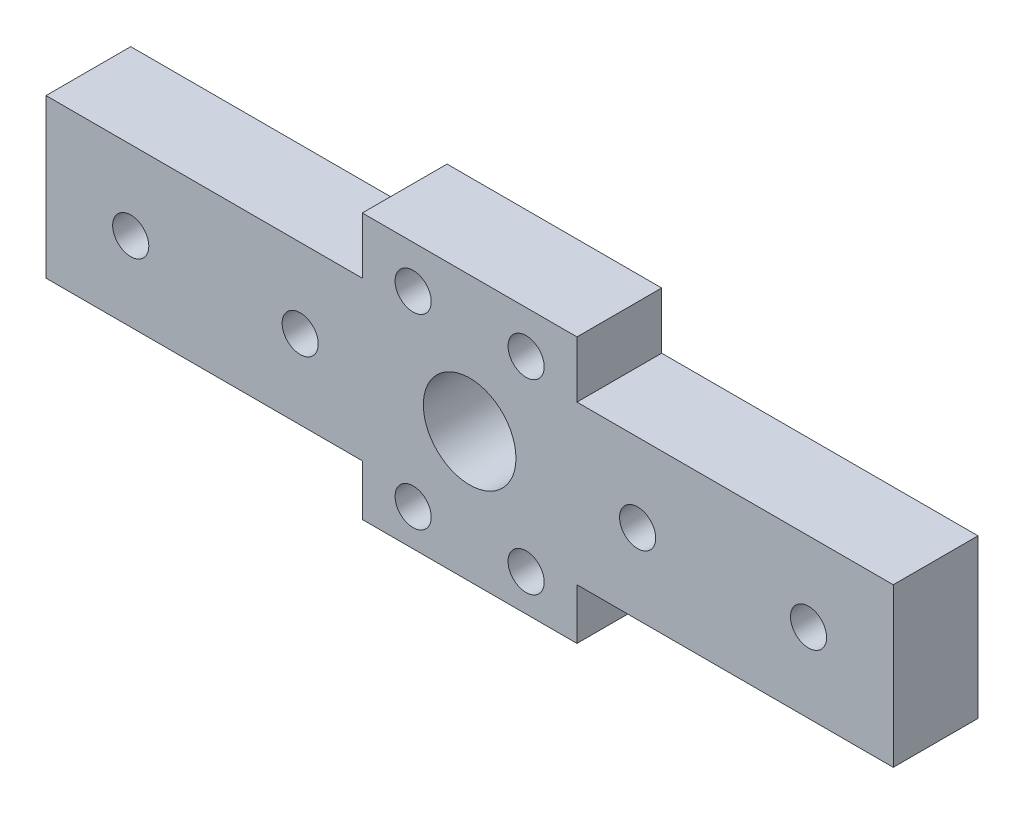
ISO-10303-21;
HEADER;
FILE_DESCRIPTION(('STEP AP214'),'2;1');
FILE_NAME('part.step','',(''),(''),'','','');
FILE_SCHEMA(('AUTOMOTIVE_DESIGN { 1 0 10303 214 1 1 1 1 }'));
ENDSEC;
DATA;
#1=APPLICATION_CONTEXT('core data for automotive mechanical design processes');
#2=APPLICATION_PROTOCOL_DEFINITION('international standard','automotive_design',2000,#1);
#3=PRODUCT_CONTEXT('',#1,'mechanical');
#4=PRODUCT('Part','Part','',(#3));
#5=PRODUCT_RELATED_PRODUCT_CATEGORY('part','',(#4));
#6=PRODUCT_DEFINITION_FORMATION('','',#4);
#7=PRODUCT_DEFINITION_CONTEXT('part definition',#1,'design');
#8=PRODUCT_DEFINITION('design','',#6,#7);
#9=PRODUCT_DEFINITION_SHAPE('','',#8);
#10=(LENGTH_UNIT() NAMED_UNIT(*) SI_UNIT(.MILLI.,.METRE.));
#11=(NAMED_UNIT(*) PLANE_ANGLE_UNIT() SI_UNIT($,.RADIAN.));
#12=(NAMED_UNIT(*) SI_UNIT($,.STERADIAN.) SOLID_ANGLE_UNIT());
#13=UNCERTAINTY_MEASURE_WITH_UNIT(LENGTH_MEASURE(1.E-05),#10,'distance_accuracy_value','');
#14=(GEOMETRIC_REPRESENTATION_CONTEXT(3) GLOBAL_UNCERTAINTY_ASSIGNED_CONTEXT((#13)) GLOBAL_UNIT_ASSIGNED_CONTEXT((#10,
#11,#12)) REPRESENTATION_CONTEXT('',''));
#15=CARTESIAN_POINT('',(0.,0.,0.));
#16=DIRECTION('',(0.,0.,1.));
#17=DIRECTION('',(1.,0.,0.));
#18=AXIS2_PLACEMENT_3D('',#15,#16,#17);
#19=CARTESIAN_POINT('',(0.,0.,7.5));
#20=DIRECTION('',(0.,0.,-1.));
#21=DIRECTION('',(-1.,0.,0.));
#22=AXIS2_PLACEMENT_3D('',#19,#20,#21);
#23=PLANE('',#22);
#24=DIRECTION('',(0.,-1.,0.));
#25=VECTOR('',#24,1.);
#26=CARTESIAN_POINT('',(0.,18.5,7.5));
#27=LINE('',#26,#25);
#28=CARTESIAN_POINT('',(0.,18.5,7.5));
#29=VERTEX_POINT('',#28);
#30=CARTESIAN_POINT('',(0.,4.5,7.5));
#31=VERTEX_POINT('',#30);
#32=EDGE_CURVE('E106',#29,#31,#27,.T.);
#33=ORIENTED_EDGE('',*,*,#32,.T.);
#34=DIRECTION('',(1.,0.,0.));
#35=VECTOR('',#34,1.);
#36=CARTESIAN_POINT('',(0.416202300678001,4.5,7.5));
#37=LINE('',#36,#35);
#38=CARTESIAN_POINT('',(28.,4.5,7.5));
#39=VERTEX_POINT('',#38);
#40=EDGE_CURVE('E247',#31,#39,#37,.T.);
#41=ORIENTED_EDGE('',*,*,#40,.T.);
#42=DIRECTION('',(0.,-1.,0.));
#43=VECTOR('',#42,1.);
#44=CARTESIAN_POINT('',(28.,4.5,7.5));
#45=LINE('',#44,#43);
#46=CARTESIAN_POINT('',(28.,0.,7.5));
#47=VERTEX_POINT('',#46);
#48=EDGE_CURVE('E206',#39,#47,#45,.T.);
#49=ORIENTED_EDGE('',*,*,#48,.T.);
#50=DIRECTION('',(1.,0.,0.));
#51=VECTOR('',#50,1.);
#52=CARTESIAN_POINT('',(28.,0.,7.5));
#53=LINE('',#52,#51);
#54=CARTESIAN_POINT('',(47.,0.,7.5));
#55=VERTEX_POINT('',#54);
#56=EDGE_CURVE('E225',#47,#55,#53,.T.);
#57=ORIENTED_EDGE('',*,*,#56,.T.);
#58=DIRECTION('',(0.,1.,0.));
#59=VECTOR('',#58,1.);
#60=CARTESIAN_POINT('',(47.,4.5,7.5));
#61=LINE('',#60,#59);
#62=CARTESIAN_POINT('',(47.,4.5,7.5));
#63=VERTEX_POINT('',#62);
#64=EDGE_CURVE('E222',#55,#63,#61,.T.);
#65=ORIENTED_EDGE('',*,*,#64,.T.);
#66=DIRECTION('',(1.,0.,0.));
#67=VECTOR('',#66,1.);
#68=CARTESIAN_POINT('',(75.,4.5,7.5));
#69=LINE('',#68,#67);
#70=CARTESIAN_POINT('',(75.,4.5,7.5));
#71=VERTEX_POINT('',#70);
#72=EDGE_CURVE('E224',#63,#71,#69,.T.);
#73=ORIENTED_EDGE('',*,*,#72,.T.);
#74=DIRECTION('',(0.,1.,0.));
#75=VECTOR('',#74,1.);
#76=CARTESIAN_POINT('',(75.,4.5,7.5));
#77=LINE('',#76,#75);
#78=CARTESIAN_POINT('',(75.,18.5,7.5));
#79=VERTEX_POINT('',#78);
#80=EDGE_CURVE('E227',#71,#79,#77,.T.);
#81=ORIENTED_EDGE('',*,*,#80,.T.);
#82=DIRECTION('',(-1.,0.,0.));
#83=VECTOR('',#82,1.);
#84=CARTESIAN_POINT('',(75.,18.5,7.5));
#85=LINE('',#84,#83);
#86=CARTESIAN_POINT('',(47.,18.5,7.5));
#87=VERTEX_POINT('',#86);
#88=EDGE_CURVE('E233',#79,#87,#85,.T.);
#89=ORIENTED_EDGE('',*,*,#88,.T.);
#90=DIRECTION('',(0.,1.,0.));
#91=VECTOR('',#90,1.);
#92=CARTESIAN_POINT('',(47.,18.5,7.5));
#93=LINE('',#92,#91);
#94=CARTESIAN_POINT('',(47.,23.5,7.5));
#95=VERTEX_POINT('',#94);
#96=EDGE_CURVE('E138',#87,#95,#93,.T.);
#97=ORIENTED_EDGE('',*,*,#96,.T.);
#98=DIRECTION('',(-1.,0.,0.));
#99=VECTOR('',#98,1.);
#100=CARTESIAN_POINT('',(47.,23.5,7.5));
#101=LINE('',#100,#99);
#102=CARTESIAN_POINT('',(28.,23.5,7.5));
#103=VERTEX_POINT('',#102);
#104=EDGE_CURVE('E132',#95,#103,#101,.T.);
#105=ORIENTED_EDGE('',*,*,#104,.T.);
#106=DIRECTION('',(0.,-1.,0.));
#107=VECTOR('',#106,1.);
#108=CARTESIAN_POINT('',(28.,23.5,7.5));
#109=LINE('',#108,#107);
#110=CARTESIAN_POINT('',(28.,18.5,7.5));
#111=VERTEX_POINT('',#110);
#112=EDGE_CURVE('E136',#103,#111,#109,.T.);
#113=ORIENTED_EDGE('',*,*,#112,.T.);
#114=DIRECTION('',(-1.,0.,0.));
#115=VECTOR('',#114,1.);
#116=CARTESIAN_POINT('',(28.,18.5,7.5));
#117=LINE('',#116,#115);
#118=EDGE_CURVE('E52',#111,#29,#117,.T.);
#119=ORIENTED_EDGE('',*,*,#118,.T.);
#120=EDGE_LOOP('',(#33,#41,#49,#57,#65,#73,#81,#89,#97,#105,#113,#119));
#121=FACE_BOUND('',#120,.T.);
#122=CARTESIAN_POINT('',(37.5,11.5,7.5));
#123=DIRECTION('',(0.,0.,1.));
#124=DIRECTION('',(1.,0.,0.));
#125=AXIS2_PLACEMENT_3D('',#122,#123,#124);
#126=CIRCLE('',#125,4.1);
#127=CARTESIAN_POINT('',(41.6,11.5,7.5));
#128=VERTEX_POINT('',#127);
#129=EDGE_CURVE('E158',#128,#128,#126,.T.);
#130=ORIENTED_EDGE('',*,*,#129,.F.);
#131=EDGE_LOOP('',(#130));
#132=FACE_BOUND('',#131,.T.);
#133=CARTESIAN_POINT('',(67.5,11.5,7.5));
#134=DIRECTION('',(0.,0.,1.));
#135=DIRECTION('',(1.,0.,0.));
#136=AXIS2_PLACEMENT_3D('',#133,#134,#135);
#137=CIRCLE('',#136,1.60000000000001);
#138=CARTESIAN_POINT('',(69.1,11.5,7.5));
#139=VERTEX_POINT('',#138);
#140=EDGE_CURVE('E513',#139,#139,#137,.T.);
#141=ORIENTED_EDGE('',*,*,#140,.F.);
#142=EDGE_LOOP('',(#141));
#143=FACE_BOUND('',#142,.T.);
#144=CARTESIAN_POINT('',(32.5000247379876,3.22775681810375,7.5));
#145=DIRECTION('',(0.,0.,1.));
#146=DIRECTION('',(1.,0.,0.));
#147=AXIS2_PLACEMENT_3D('',#144,#145,#146);
#148=CIRCLE('',#147,1.6);
#149=CARTESIAN_POINT('',(34.1000247379876,3.22775681810375,7.5));
#150=VERTEX_POINT('',#149);
#151=EDGE_CURVE('E507',#150,#150,#148,.T.);
#152=ORIENTED_EDGE('',*,*,#151,.F.);
#153=EDGE_LOOP('',(#152));
#154=FACE_BOUND('',#153,.T.);
#155=CARTESIAN_POINT('',(42.5,3.25,7.5));
#156=DIRECTION('',(0.,0.,1.));
#157=DIRECTION('',(1.,0.,0.));
#158=AXIS2_PLACEMENT_3D('',#155,#156,#157);
#159=CIRCLE('',#158,1.6);
#160=CARTESIAN_POINT('',(44.1,3.25,7.5));
#161=VERTEX_POINT('',#160);
#162=EDGE_CURVE('E501',#161,#161,#159,.T.);
#163=ORIENTED_EDGE('',*,*,#162,.F.);
#164=EDGE_LOOP('',(#163));
#165=FACE_BOUND('',#164,.T.);
#166=CARTESIAN_POINT('',(42.5,19.75,7.5));
#167=DIRECTION('',(0.,0.,1.));
#168=DIRECTION('',(1.,0.,0.));
#169=AXIS2_PLACEMENT_3D('',#166,#167,#168);
#170=CIRCLE('',#169,1.6);
#171=CARTESIAN_POINT('',(44.1,19.75,7.5));
#172=VERTEX_POINT('',#171);
#173=EDGE_CURVE('E495',#172,#172,#170,.T.);
#174=ORIENTED_EDGE('',*,*,#173,.F.);
#175=EDGE_LOOP('',(#174));
#176=FACE_BOUND('',#175,.T.);
#177=CARTESIAN_POINT('',(32.5000247379876,19.75,7.5));
#178=DIRECTION('',(0.,0.,1.));
#179=DIRECTION('',(1.,0.,0.));
#180=AXIS2_PLACEMENT_3D('',#177,#178,#179);
#181=CIRCLE('',#180,1.6);
#182=CARTESIAN_POINT('',(34.1000247379876,19.75,7.5));
#183=VERTEX_POINT('',#182);
#184=EDGE_CURVE('E489',#183,#183,#181,.T.);
#185=ORIENTED_EDGE('',*,*,#184,.F.);
#186=EDGE_LOOP('',(#185));
#187=FACE_BOUND('',#186,.T.);
#188=CARTESIAN_POINT('',(7.5,11.5,7.5));
#189=DIRECTION('',(0.,0.,1.));
#190=DIRECTION('',(1.,0.,0.));
#191=AXIS2_PLACEMENT_3D('',#188,#189,#190);
#192=CIRCLE('',#191,1.6);
#193=CARTESIAN_POINT('',(9.1,11.5,7.5));
#194=VERTEX_POINT('',#193);
#195=EDGE_CURVE('E483',#194,#194,#192,.T.);
#196=ORIENTED_EDGE('',*,*,#195,.F.);
#197=EDGE_LOOP('',(#196));
#198=FACE_BOUND('',#197,.T.);
#199=CARTESIAN_POINT('',(52.37048673733,11.5540338308652,7.5));
#200=DIRECTION('',(0.,0.,1.));
#201=DIRECTION('',(1.,0.,0.));
#202=AXIS2_PLACEMENT_3D('',#199,#200,#201);
#203=CIRCLE('',#202,1.6);
#204=CARTESIAN_POINT('',(53.97048673733,11.5540338308652,7.5));
#205=VERTEX_POINT('',#204);
#206=EDGE_CURVE('E477',#205,#205,#203,.T.);
#207=ORIENTED_EDGE('',*,*,#206,.F.);
#208=EDGE_LOOP('',(#207));
#209=FACE_BOUND('',#208,.T.);
#210=CARTESIAN_POINT('',(22.5,11.5,7.5));
#211=DIRECTION('',(0.,0.,1.));
#212=DIRECTION('',(1.,0.,0.));
#213=AXIS2_PLACEMENT_3D('',#210,#211,#212);
#214=CIRCLE('',#213,1.6);
#215=CARTESIAN_POINT('',(24.1,11.5,7.5));
#216=VERTEX_POINT('',#215);
#217=EDGE_CURVE('E468',#216,#216,#214,.T.);
#218=ORIENTED_EDGE('',*,*,#217,.F.);
#219=EDGE_LOOP('',(#218));
#220=FACE_BOUND('',#219,.T.);
#221=ADVANCED_FACE('F35',(#121,#132,#143,#154,#165,#176,#187,#198,#209,#220),#23,.F.);
#222=CARTESIAN_POINT('',(0.,0.,0.));
#223=DIRECTION('',(0.,0.,-1.));
#224=DIRECTION('',(-1.,0.,0.));
#225=AXIS2_PLACEMENT_3D('',#222,#223,#224);
#226=PLANE('',#225);
#227=CARTESIAN_POINT('',(52.37048673733,11.5540338308652,0.));
#228=DIRECTION('',(0.,0.,1.));
#229=DIRECTION('',(1.,0.,0.));
#230=AXIS2_PLACEMENT_3D('',#227,#228,#229);
#231=CIRCLE('',#230,1.6);
#232=CARTESIAN_POINT('',(53.97048673733,11.5540338308652,0.));
#233=VERTEX_POINT('',#232);
#234=EDGE_CURVE('E474',#233,#233,#231,.T.);
#235=ORIENTED_EDGE('',*,*,#234,.T.);
#236=EDGE_LOOP('',(#235));
#237=FACE_BOUND('',#236,.T.);
#238=CARTESIAN_POINT('',(32.5000247379876,19.75,0.));
#239=DIRECTION('',(0.,0.,1.));
#240=DIRECTION('',(1.,0.,0.));
#241=AXIS2_PLACEMENT_3D('',#238,#239,#240);
#242=CIRCLE('',#241,1.6);
#243=CARTESIAN_POINT('',(34.1000247379876,19.75,0.));
#244=VERTEX_POINT('',#243);
#245=EDGE_CURVE('E486',#244,#244,#242,.T.);
#246=ORIENTED_EDGE('',*,*,#245,.T.);
#247=EDGE_LOOP('',(#246));
#248=FACE_BOUND('',#247,.T.);
#249=CARTESIAN_POINT('',(42.5,3.25,0.));
#250=DIRECTION('',(0.,0.,1.));
#251=DIRECTION('',(1.,0.,0.));
#252=AXIS2_PLACEMENT_3D('',#249,#250,#251);
#253=CIRCLE('',#252,1.6);
#254=CARTESIAN_POINT('',(44.1,3.25,0.));
#255=VERTEX_POINT('',#254);
#256=EDGE_CURVE('E498',#255,#255,#253,.T.);
#257=ORIENTED_EDGE('',*,*,#256,.T.);
#258=EDGE_LOOP('',(#257));
#259=FACE_BOUND('',#258,.T.);
#260=CARTESIAN_POINT('',(67.5,11.5,0.));
#261=DIRECTION('',(0.,0.,1.));
#262=DIRECTION('',(1.,0.,0.));
#263=AXIS2_PLACEMENT_3D('',#260,#261,#262);
#264=CIRCLE('',#263,1.60000000000001);
#265=CARTESIAN_POINT('',(69.1,11.5,0.));
#266=VERTEX_POINT('',#265);
#267=EDGE_CURVE('E510',#266,#266,#264,.T.);
#268=ORIENTED_EDGE('',*,*,#267,.T.);
#269=EDGE_LOOP('',(#268));
#270=FACE_BOUND('',#269,.T.);
#271=DIRECTION('',(0.,-1.,0.));
#272=VECTOR('',#271,1.);
#273=CARTESIAN_POINT('',(0.,11.5,0.));
#274=LINE('',#273,#272);
#275=CARTESIAN_POINT('',(0.,18.5,0.));
#276=VERTEX_POINT('',#275);
#277=CARTESIAN_POINT('',(0.,4.5,0.));
#278=VERTEX_POINT('',#277);
#279=EDGE_CURVE('E100',#276,#278,#274,.T.);
#280=ORIENTED_EDGE('',*,*,#279,.F.);
#281=DIRECTION('',(-1.,0.,0.));
#282=VECTOR('',#281,1.);
#283=CARTESIAN_POINT('',(28.,18.5,0.));
#284=LINE('',#283,#282);
#285=CARTESIAN_POINT('',(28.,18.5,0.));
#286=VERTEX_POINT('',#285);
#287=EDGE_CURVE('E176',#286,#276,#284,.T.);
#288=ORIENTED_EDGE('',*,*,#287,.F.);
#289=DIRECTION('',(0.,-1.,0.));
#290=VECTOR('',#289,1.);
#291=CARTESIAN_POINT('',(28.,23.5,0.));
#292=LINE('',#291,#290);
#293=CARTESIAN_POINT('',(28.,23.5,0.));
#294=VERTEX_POINT('',#293);
#295=EDGE_CURVE('E93',#294,#286,#292,.T.);
#296=ORIENTED_EDGE('',*,*,#295,.F.);
#297=DIRECTION('',(-1.,0.,0.));
#298=VECTOR('',#297,1.);
#299=CARTESIAN_POINT('',(47.,23.5,0.));
#300=LINE('',#299,#298);
#301=CARTESIAN_POINT('',(47.,23.5,0.));
#302=VERTEX_POINT('',#301);
#303=EDGE_CURVE('E146',#302,#294,#300,.T.);
#304=ORIENTED_EDGE('',*,*,#303,.F.);
#305=DIRECTION('',(0.,1.,0.));
#306=VECTOR('',#305,1.);
#307=CARTESIAN_POINT('',(47.,18.5,0.));
#308=LINE('',#307,#306);
#309=CARTESIAN_POINT('',(47.,18.5,0.));
#310=VERTEX_POINT('',#309);
#311=EDGE_CURVE('E172',#310,#302,#308,.T.);
#312=ORIENTED_EDGE('',*,*,#311,.F.);
#313=DIRECTION('',(-1.,0.,0.));
#314=VECTOR('',#313,1.);
#315=CARTESIAN_POINT('',(75.,18.5,0.));
#316=LINE('',#315,#314);
#317=CARTESIAN_POINT('',(75.,18.5,0.));
#318=VERTEX_POINT('',#317);
#319=EDGE_CURVE('E170',#318,#310,#316,.T.);
#320=ORIENTED_EDGE('',*,*,#319,.F.);
#321=DIRECTION('',(0.,1.,0.));
#322=VECTOR('',#321,1.);
#323=CARTESIAN_POINT('',(75.,4.5,0.));
#324=LINE('',#323,#322);
#325=CARTESIAN_POINT('',(75.,4.5,0.));
#326=VERTEX_POINT('',#325);
#327=EDGE_CURVE('E168',#326,#318,#324,.T.);
#328=ORIENTED_EDGE('',*,*,#327,.F.);
#329=DIRECTION('',(1.,0.,0.));
#330=VECTOR('',#329,1.);
#331=CARTESIAN_POINT('',(75.,4.5,0.));
#332=LINE('',#331,#330);
#333=CARTESIAN_POINT('',(47.,4.5,0.));
#334=VERTEX_POINT('',#333);
#335=EDGE_CURVE('E166',#334,#326,#332,.T.);
#336=ORIENTED_EDGE('',*,*,#335,.F.);
#337=DIRECTION('',(0.,1.,0.));
#338=VECTOR('',#337,1.);
#339=CARTESIAN_POINT('',(47.,4.5,0.));
#340=LINE('',#339,#338);
#341=CARTESIAN_POINT('',(47.,0.,0.));
#342=VERTEX_POINT('',#341);
#343=EDGE_CURVE('E164',#342,#334,#340,.T.);
#344=ORIENTED_EDGE('',*,*,#343,.F.);
#345=DIRECTION('',(1.,0.,0.));
#346=VECTOR('',#345,1.);
#347=CARTESIAN_POINT('',(28.,0.,0.));
#348=LINE('',#347,#346);
#349=CARTESIAN_POINT('',(28.,0.,0.));
#350=VERTEX_POINT('',#349);
#351=EDGE_CURVE('E162',#350,#342,#348,.T.);
#352=ORIENTED_EDGE('',*,*,#351,.F.);
#353=DIRECTION('',(0.,-1.,0.));
#354=VECTOR('',#353,1.);
#355=CARTESIAN_POINT('',(28.,4.5,0.));
#356=LINE('',#355,#354);
#357=CARTESIAN_POINT('',(28.,4.5,0.));
#358=VERTEX_POINT('',#357);
#359=EDGE_CURVE('E160',#358,#350,#356,.T.);
#360=ORIENTED_EDGE('',*,*,#359,.F.);
#361=DIRECTION('',(1.,0.,0.));
#362=VECTOR('',#361,1.);
#363=CARTESIAN_POINT('',(28.,4.5,0.));
#364=LINE('',#363,#362);
#365=EDGE_CURVE('E157',#278,#358,#364,.T.);
#366=ORIENTED_EDGE('',*,*,#365,.F.);
#367=EDGE_LOOP('',(#280,#288,#296,#304,#312,#320,#328,#336,#344,#352,#360,#366));
#368=FACE_BOUND('',#367,.T.);
#369=CARTESIAN_POINT('',(37.5,11.5,0.));
#370=DIRECTION('',(0.,0.,1.));
#371=DIRECTION('',(1.,0.,0.));
#372=AXIS2_PLACEMENT_3D('',#369,#370,#371);
#373=CIRCLE('',#372,4.1);
#374=CARTESIAN_POINT('',(41.6,11.5,0.));
#375=VERTEX_POINT('',#374);
#376=EDGE_CURVE('E251',#375,#375,#373,.T.);
#377=ORIENTED_EDGE('',*,*,#376,.T.);
#378=EDGE_LOOP('',(#377));
#379=FACE_BOUND('',#378,.T.);
#380=CARTESIAN_POINT('',(32.5000247379876,3.22775681810375,0.));
#381=DIRECTION('',(0.,0.,1.));
#382=DIRECTION('',(1.,0.,0.));
#383=AXIS2_PLACEMENT_3D('',#380,#381,#382);
#384=CIRCLE('',#383,1.6);
#385=CARTESIAN_POINT('',(34.1000247379876,3.22775681810375,0.));
#386=VERTEX_POINT('',#385);
#387=EDGE_CURVE('E504',#386,#386,#384,.T.);
#388=ORIENTED_EDGE('',*,*,#387,.T.);
#389=EDGE_LOOP('',(#388));
#390=FACE_BOUND('',#389,.T.);
#391=CARTESIAN_POINT('',(42.5,19.75,0.));
#392=DIRECTION('',(0.,0.,1.));
#393=DIRECTION('',(1.,0.,0.));
#394=AXIS2_PLACEMENT_3D('',#391,#392,#393);
#395=CIRCLE('',#394,1.6);
#396=CARTESIAN_POINT('',(44.1,19.75,0.));
#397=VERTEX_POINT('',#396);
#398=EDGE_CURVE('E492',#397,#397,#395,.T.);
#399=ORIENTED_EDGE('',*,*,#398,.T.);
#400=EDGE_LOOP('',(#399));
#401=FACE_BOUND('',#400,.T.);
#402=CARTESIAN_POINT('',(7.5,11.5,0.));
#403=DIRECTION('',(0.,0.,1.));
#404=DIRECTION('',(1.,0.,0.));
#405=AXIS2_PLACEMENT_3D('',#402,#403,#404);
#406=CIRCLE('',#405,1.6);
#407=CARTESIAN_POINT('',(9.1,11.5,0.));
#408=VERTEX_POINT('',#407);
#409=EDGE_CURVE('E480',#408,#408,#406,.T.);
#410=ORIENTED_EDGE('',*,*,#409,.T.);
#411=EDGE_LOOP('',(#410));
#412=FACE_BOUND('',#411,.T.);
#413=CARTESIAN_POINT('',(22.5,11.5,0.));
#414=DIRECTION('',(0.,0.,1.));
#415=DIRECTION('',(1.,0.,0.));
#416=AXIS2_PLACEMENT_3D('',#413,#414,#415);
#417=CIRCLE('',#416,1.6);
#418=CARTESIAN_POINT('',(24.1,11.5,0.));
#419=VERTEX_POINT('',#418);
#420=EDGE_CURVE('E471',#419,#419,#417,.T.);
#421=ORIENTED_EDGE('',*,*,#420,.T.);
#422=EDGE_LOOP('',(#421));
#423=FACE_BOUND('',#422,.T.);
#424=ADVANCED_FACE('F210',(#237,#248,#259,#270,#368,#379,#390,#401,#412,#423),#226,.T.);
#425=CARTESIAN_POINT('',(0.,11.5,7.5));
#426=DIRECTION('',(1.,0.,0.));
#427=DIRECTION('',(0.,0.,-1.));
#428=AXIS2_PLACEMENT_3D('',#425,#426,#427);
#429=PLANE('',#428);
#430=ORIENTED_EDGE('',*,*,#279,.T.);
#431=DIRECTION('',(0.,0.,-1.));
#432=VECTOR('',#431,1.);
#433=CARTESIAN_POINT('',(0.,4.5,7.5));
#434=LINE('',#433,#432);
#435=EDGE_CURVE('E11',#31,#278,#434,.T.);
#436=ORIENTED_EDGE('',*,*,#435,.F.);
#437=ORIENTED_EDGE('',*,*,#32,.F.);
#438=DIRECTION('',(0.,0.,-1.));
#439=VECTOR('',#438,1.);
#440=CARTESIAN_POINT('',(0.,18.5,7.5));
#441=LINE('',#440,#439);
#442=EDGE_CURVE('E152',#29,#276,#441,.T.);
#443=ORIENTED_EDGE('',*,*,#442,.T.);
#444=EDGE_LOOP('',(#430,#436,#437,#443));
#445=FACE_BOUND('',#444,.T.);
#446=ADVANCED_FACE('F37',(#445),#429,.F.);
#447=CARTESIAN_POINT('',(28.,4.5,7.5));
#448=DIRECTION('',(0.,1.,0.));
#449=DIRECTION('',(0.,0.,1.));
#450=AXIS2_PLACEMENT_3D('',#447,#448,#449);
#451=PLANE('',#450);
#452=ORIENTED_EDGE('',*,*,#365,.T.);
#453=DIRECTION('',(0.,0.,-1.));
#454=VECTOR('',#453,1.);
#455=CARTESIAN_POINT('',(28.,4.5,7.5));
#456=LINE('',#455,#454);
#457=EDGE_CURVE('E44',#39,#358,#456,.T.);
#458=ORIENTED_EDGE('',*,*,#457,.F.);
#459=ORIENTED_EDGE('',*,*,#40,.F.);
#460=ORIENTED_EDGE('',*,*,#435,.T.);
#461=EDGE_LOOP('',(#452,#458,#459,#460));
#462=FACE_BOUND('',#461,.T.);
#463=ADVANCED_FACE('F253',(#462),#451,.F.);
#464=CARTESIAN_POINT('',(28.,4.5,7.5));
#465=DIRECTION('',(1.,0.,0.));
#466=DIRECTION('',(0.,0.,-1.));
#467=AXIS2_PLACEMENT_3D('',#464,#465,#466);
#468=PLANE('',#467);
#469=ORIENTED_EDGE('',*,*,#359,.T.);
#470=DIRECTION('',(0.,0.,-1.));
#471=VECTOR('',#470,1.);
#472=CARTESIAN_POINT('',(28.,0.,7.5));
#473=LINE('',#472,#471);
#474=EDGE_CURVE('E197',#47,#350,#473,.T.);
#475=ORIENTED_EDGE('',*,*,#474,.F.);
#476=ORIENTED_EDGE('',*,*,#48,.F.);
#477=ORIENTED_EDGE('',*,*,#457,.T.);
#478=EDGE_LOOP('',(#469,#475,#476,#477));
#479=FACE_BOUND('',#478,.T.);
#480=ADVANCED_FACE('F204',(#479),#468,.F.);
#481=CARTESIAN_POINT('',(28.,0.,7.5));
#482=DIRECTION('',(0.,1.,0.));
#483=DIRECTION('',(0.,0.,1.));
#484=AXIS2_PLACEMENT_3D('',#481,#482,#483);
#485=PLANE('',#484);
#486=ORIENTED_EDGE('',*,*,#351,.T.);
#487=DIRECTION('',(0.,0.,-1.));
#488=VECTOR('',#487,1.);
#489=CARTESIAN_POINT('',(47.,0.,7.5));
#490=LINE('',#489,#488);
#491=EDGE_CURVE('E194',#55,#342,#490,.T.);
#492=ORIENTED_EDGE('',*,*,#491,.F.);
#493=ORIENTED_EDGE('',*,*,#56,.F.);
#494=ORIENTED_EDGE('',*,*,#474,.T.);
#495=EDGE_LOOP('',(#486,#492,#493,#494));
#496=FACE_BOUND('',#495,.T.);
#497=ADVANCED_FACE('F216',(#496),#485,.F.);
#498=CARTESIAN_POINT('',(47.,4.5,7.5));
#499=DIRECTION('',(-1.,0.,0.));
#500=DIRECTION('',(0.,0.,1.));
#501=AXIS2_PLACEMENT_3D('',#498,#499,#500);
#502=PLANE('',#501);
#503=ORIENTED_EDGE('',*,*,#343,.T.);
#504=DIRECTION('',(0.,0.,-1.));
#505=VECTOR('',#504,1.);
#506=CARTESIAN_POINT('',(47.,4.5,7.5));
#507=LINE('',#506,#505);
#508=EDGE_CURVE('E191',#63,#334,#507,.T.);
#509=ORIENTED_EDGE('',*,*,#508,.F.);
#510=ORIENTED_EDGE('',*,*,#64,.F.);
#511=ORIENTED_EDGE('',*,*,#491,.T.);
#512=EDGE_LOOP('',(#503,#509,#510,#511));
#513=FACE_BOUND('',#512,.T.);
#514=ADVANCED_FACE('F220',(#513),#502,.F.);
#515=CARTESIAN_POINT('',(75.,4.5,7.5));
#516=DIRECTION('',(0.,1.,0.));
#517=DIRECTION('',(0.,0.,1.));
#518=AXIS2_PLACEMENT_3D('',#515,#516,#517);
#519=PLANE('',#518);
#520=ORIENTED_EDGE('',*,*,#335,.T.);
#521=DIRECTION('',(0.,0.,-1.));
#522=VECTOR('',#521,1.);
#523=CARTESIAN_POINT('',(75.,4.5,7.5));
#524=LINE('',#523,#522);
#525=EDGE_CURVE('E188',#71,#326,#524,.T.);
#526=ORIENTED_EDGE('',*,*,#525,.F.);
#527=ORIENTED_EDGE('',*,*,#72,.F.);
#528=ORIENTED_EDGE('',*,*,#508,.T.);
#529=EDGE_LOOP('',(#520,#526,#527,#528));
#530=FACE_BOUND('',#529,.T.);
#531=ADVANCED_FACE('F284',(#530),#519,.F.);
#532=CARTESIAN_POINT('',(75.,4.5,7.5));
#533=DIRECTION('',(-1.,0.,0.));
#534=DIRECTION('',(0.,0.,1.));
#535=AXIS2_PLACEMENT_3D('',#532,#533,#534);
#536=PLANE('',#535);
#537=ORIENTED_EDGE('',*,*,#327,.T.);
#538=DIRECTION('',(0.,0.,-1.));
#539=VECTOR('',#538,1.);
#540=CARTESIAN_POINT('',(75.,18.5,7.5));
#541=LINE('',#540,#539);
#542=EDGE_CURVE('E185',#79,#318,#541,.T.);
#543=ORIENTED_EDGE('',*,*,#542,.F.);
#544=ORIENTED_EDGE('',*,*,#80,.F.);
#545=ORIENTED_EDGE('',*,*,#525,.T.);
#546=EDGE_LOOP('',(#537,#543,#544,#545));
#547=FACE_BOUND('',#546,.T.);
#548=ADVANCED_FACE('F281',(#547),#536,.F.);
#549=CARTESIAN_POINT('',(75.,18.5,7.5));
#550=DIRECTION('',(0.,-1.,0.));
#551=DIRECTION('',(0.,0.,-1.));
#552=AXIS2_PLACEMENT_3D('',#549,#550,#551);
#553=PLANE('',#552);
#554=ORIENTED_EDGE('',*,*,#319,.T.);
#555=DIRECTION('',(0.,0.,-1.));
#556=VECTOR('',#555,1.);
#557=CARTESIAN_POINT('',(47.,18.5,7.5));
#558=LINE('',#557,#556);
#559=EDGE_CURVE('E182',#87,#310,#558,.T.);
#560=ORIENTED_EDGE('',*,*,#559,.F.);
#561=ORIENTED_EDGE('',*,*,#88,.F.);
#562=ORIENTED_EDGE('',*,*,#542,.T.);
#563=EDGE_LOOP('',(#554,#560,#561,#562));
#564=FACE_BOUND('',#563,.T.);
#565=ADVANCED_FACE('F239',(#564),#553,.F.);
#566=CARTESIAN_POINT('',(47.,18.5,7.5));
#567=DIRECTION('',(-1.,0.,0.));
#568=DIRECTION('',(0.,0.,1.));
#569=AXIS2_PLACEMENT_3D('',#566,#567,#568);
#570=PLANE('',#569);
#571=ORIENTED_EDGE('',*,*,#311,.T.);
#572=DIRECTION('',(0.,0.,-1.));
#573=VECTOR('',#572,1.);
#574=CARTESIAN_POINT('',(47.,23.5,7.5));
#575=LINE('',#574,#573);
#576=EDGE_CURVE('E147',#95,#302,#575,.T.);
#577=ORIENTED_EDGE('',*,*,#576,.F.);
#578=ORIENTED_EDGE('',*,*,#96,.F.);
#579=ORIENTED_EDGE('',*,*,#559,.T.);
#580=EDGE_LOOP('',(#571,#577,#578,#579));
#581=FACE_BOUND('',#580,.T.);
#582=ADVANCED_FACE('F243',(#581),#570,.F.);
#583=CARTESIAN_POINT('',(47.,23.5,7.5));
#584=DIRECTION('',(0.,-1.,0.));
#585=DIRECTION('',(0.,0.,-1.));
#586=AXIS2_PLACEMENT_3D('',#583,#584,#585);
#587=PLANE('',#586);
#588=ORIENTED_EDGE('',*,*,#303,.T.);
#589=DIRECTION('',(0.,0.,-1.));
#590=VECTOR('',#589,1.);
#591=CARTESIAN_POINT('',(28.,23.5,7.5));
#592=LINE('',#591,#590);
#593=EDGE_CURVE('E143',#103,#294,#592,.T.);
#594=ORIENTED_EDGE('',*,*,#593,.F.);
#595=ORIENTED_EDGE('',*,*,#104,.F.);
#596=ORIENTED_EDGE('',*,*,#576,.T.);
#597=EDGE_LOOP('',(#588,#594,#595,#596));
#598=FACE_BOUND('',#597,.T.);
#599=ADVANCED_FACE('F144',(#598),#587,.F.);
#600=CARTESIAN_POINT('',(28.,23.5,7.5));
#601=DIRECTION('',(1.,0.,0.));
#602=DIRECTION('',(0.,0.,-1.));
#603=AXIS2_PLACEMENT_3D('',#600,#601,#602);
#604=PLANE('',#603);
#605=ORIENTED_EDGE('',*,*,#295,.T.);
#606=DIRECTION('',(0.,0.,-1.));
#607=VECTOR('',#606,1.);
#608=CARTESIAN_POINT('',(28.,18.5,7.5));
#609=LINE('',#608,#607);
#610=EDGE_CURVE('E148',#111,#286,#609,.T.);
#611=ORIENTED_EDGE('',*,*,#610,.F.);
#612=ORIENTED_EDGE('',*,*,#112,.F.);
#613=ORIENTED_EDGE('',*,*,#593,.T.);
#614=EDGE_LOOP('',(#605,#611,#612,#613));
#615=FACE_BOUND('',#614,.T.);
#616=ADVANCED_FACE('F150',(#615),#604,.F.);
#617=CARTESIAN_POINT('',(28.,18.5,7.5));
#618=DIRECTION('',(0.,-1.,0.));
#619=DIRECTION('',(0.,0.,-1.));
#620=AXIS2_PLACEMENT_3D('',#617,#618,#619);
#621=PLANE('',#620);
#622=ORIENTED_EDGE('',*,*,#287,.T.);
#623=ORIENTED_EDGE('',*,*,#442,.F.);
#624=ORIENTED_EDGE('',*,*,#118,.F.);
#625=ORIENTED_EDGE('',*,*,#610,.T.);
#626=EDGE_LOOP('',(#622,#623,#624,#625));
#627=FACE_BOUND('',#626,.T.);
#628=ADVANCED_FACE('F245',(#627),#621,.F.);
#629=CARTESIAN_POINT('',(37.5,11.5,7.5));
#630=DIRECTION('',(0.,0.,-1.));
#631=DIRECTION('',(-1.,0.,0.));
#632=AXIS2_PLACEMENT_3D('',#629,#630,#631);
#633=CYLINDRICAL_SURFACE('',#632,4.1);
#634=ORIENTED_EDGE('',*,*,#129,.T.);
#635=EDGE_LOOP('',(#634));
#636=FACE_BOUND('',#635,.T.);
#637=ORIENTED_EDGE('',*,*,#376,.F.);
#638=EDGE_LOOP('',(#637));
#639=FACE_BOUND('',#638,.T.);
#640=ADVANCED_FACE('F268',(#636,#639),#633,.F.);
#641=CARTESIAN_POINT('',(67.5,11.5,7.5));
#642=DIRECTION('',(0.,0.,-1.));
#643=DIRECTION('',(-1.,0.,0.));
#644=AXIS2_PLACEMENT_3D('',#641,#642,#643);
#645=CYLINDRICAL_SURFACE('',#644,1.60000000000001);
#646=ORIENTED_EDGE('',*,*,#140,.T.);
#647=EDGE_LOOP('',(#646));
#648=FACE_BOUND('',#647,.T.);
#649=ORIENTED_EDGE('',*,*,#267,.F.);
#650=EDGE_LOOP('',(#649));
#651=FACE_BOUND('',#650,.T.);
#652=ADVANCED_FACE('F334',(#648,#651),#645,.F.);
#653=CARTESIAN_POINT('',(32.5000247379876,3.22775681810375,7.5));
#654=DIRECTION('',(0.,0.,-1.));
#655=DIRECTION('',(-1.,0.,0.));
#656=AXIS2_PLACEMENT_3D('',#653,#654,#655);
#657=CYLINDRICAL_SURFACE('',#656,1.6);
#658=ORIENTED_EDGE('',*,*,#151,.T.);
#659=EDGE_LOOP('',(#658));
#660=FACE_BOUND('',#659,.T.);
#661=ORIENTED_EDGE('',*,*,#387,.F.);
#662=EDGE_LOOP('',(#661));
#663=FACE_BOUND('',#662,.T.);
#664=ADVANCED_FACE('F341',(#660,#663),#657,.F.);
#665=CARTESIAN_POINT('',(42.5,3.25,7.5));
#666=DIRECTION('',(0.,0.,-1.));
#667=DIRECTION('',(-1.,0.,0.));
#668=AXIS2_PLACEMENT_3D('',#665,#666,#667);
#669=CYLINDRICAL_SURFACE('',#668,1.6);
#670=ORIENTED_EDGE('',*,*,#162,.T.);
#671=EDGE_LOOP('',(#670));
#672=FACE_BOUND('',#671,.T.);
#673=ORIENTED_EDGE('',*,*,#256,.F.);
#674=EDGE_LOOP('',(#673));
#675=FACE_BOUND('',#674,.T.);
#676=ADVANCED_FACE('F348',(#672,#675),#669,.F.);
#677=CARTESIAN_POINT('',(42.5,19.75,7.5));
#678=DIRECTION('',(0.,0.,-1.));
#679=DIRECTION('',(-1.,0.,0.));
#680=AXIS2_PLACEMENT_3D('',#677,#678,#679);
#681=CYLINDRICAL_SURFACE('',#680,1.6);
#682=ORIENTED_EDGE('',*,*,#173,.T.);
#683=EDGE_LOOP('',(#682));
#684=FACE_BOUND('',#683,.T.);
#685=ORIENTED_EDGE('',*,*,#398,.F.);
#686=EDGE_LOOP('',(#685));
#687=FACE_BOUND('',#686,.T.);
#688=ADVANCED_FACE('F356',(#684,#687),#681,.F.);
#689=CARTESIAN_POINT('',(32.5000247379876,19.75,7.5));
#690=DIRECTION('',(0.,0.,-1.));
#691=DIRECTION('',(-1.,0.,0.));
#692=AXIS2_PLACEMENT_3D('',#689,#690,#691);
#693=CYLINDRICAL_SURFACE('',#692,1.6);
#694=ORIENTED_EDGE('',*,*,#184,.T.);
#695=EDGE_LOOP('',(#694));
#696=FACE_BOUND('',#695,.T.);
#697=ORIENTED_EDGE('',*,*,#245,.F.);
#698=EDGE_LOOP('',(#697));
#699=FACE_BOUND('',#698,.T.);
#700=ADVANCED_FACE('F364',(#696,#699),#693,.F.);
#701=CARTESIAN_POINT('',(7.5,11.5,7.5));
#702=DIRECTION('',(0.,0.,-1.));
#703=DIRECTION('',(-1.,0.,0.));
#704=AXIS2_PLACEMENT_3D('',#701,#702,#703);
#705=CYLINDRICAL_SURFACE('',#704,1.6);
#706=ORIENTED_EDGE('',*,*,#195,.T.);
#707=EDGE_LOOP('',(#706));
#708=FACE_BOUND('',#707,.T.);
#709=ORIENTED_EDGE('',*,*,#409,.F.);
#710=EDGE_LOOP('',(#709));
#711=FACE_BOUND('',#710,.T.);
#712=ADVANCED_FACE('F372',(#708,#711),#705,.F.);
#713=CARTESIAN_POINT('',(52.37048673733,11.5540338308652,7.5));
#714=DIRECTION('',(0.,0.,-1.));
#715=DIRECTION('',(-1.,0.,0.));
#716=AXIS2_PLACEMENT_3D('',#713,#714,#715);
#717=CYLINDRICAL_SURFACE('',#716,1.6);
#718=ORIENTED_EDGE('',*,*,#206,.T.);
#719=EDGE_LOOP('',(#718));
#720=FACE_BOUND('',#719,.T.);
#721=ORIENTED_EDGE('',*,*,#234,.F.);
#722=EDGE_LOOP('',(#721));
#723=FACE_BOUND('',#722,.T.);
#724=ADVANCED_FACE('F380',(#720,#723),#717,.F.);
#725=CARTESIAN_POINT('',(22.5,11.5,7.5));
#726=DIRECTION('',(0.,0.,-1.));
#727=DIRECTION('',(-1.,0.,0.));
#728=AXIS2_PLACEMENT_3D('',#725,#726,#727);
#729=CYLINDRICAL_SURFACE('',#728,1.6);
#730=ORIENTED_EDGE('',*,*,#217,.T.);
#731=EDGE_LOOP('',(#730));
#732=FACE_BOUND('',#731,.T.);
#733=ORIENTED_EDGE('',*,*,#420,.F.);
#734=EDGE_LOOP('',(#733));
#735=FACE_BOUND('',#734,.T.);
#736=ADVANCED_FACE('F388',(#732,#735),#729,.F.);
#737=CLOSED_SHELL('',(#221,#424,#446,#463,#480,#497,#514,#531,#548,#565,#582,#599,#616,#628,
#640,#652,#664,#676,#688,#700,#712,#724,#736));
#738=MANIFOLD_SOLID_BREP('B2',#737);
#739=ADVANCED_BREP_SHAPE_REPRESENTATION('',(#18,#738),#14);
#740=SHAPE_DEFINITION_REPRESENTATION(#9,#739);
ENDSEC;
END-ISO-10303-21;
